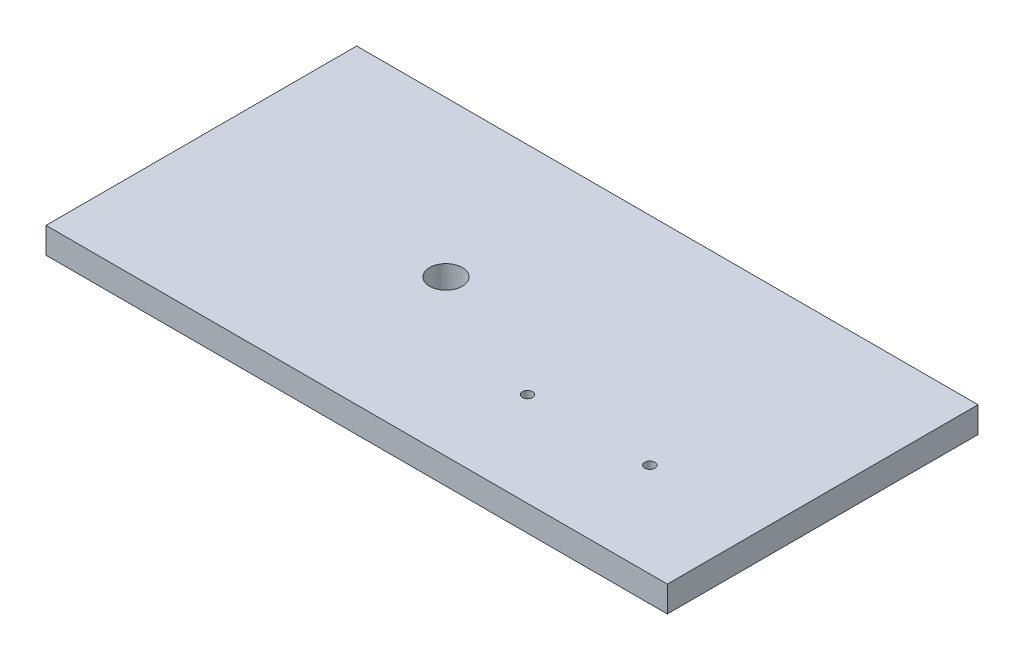
ISO-10303-21;
HEADER;
FILE_DESCRIPTION(('STEP AP214'),'2;1');
FILE_NAME('part.step','',(''),(''),'','','');
FILE_SCHEMA(('AUTOMOTIVE_DESIGN { 1 0 10303 214 1 1 1 1 }'));
ENDSEC;
DATA;
#1=APPLICATION_CONTEXT('core data for automotive mechanical design processes');
#2=APPLICATION_PROTOCOL_DEFINITION('international standard','automotive_design',2000,#1);
#3=PRODUCT_CONTEXT('',#1,'mechanical');
#4=PRODUCT('Part','Part','',(#3));
#5=PRODUCT_RELATED_PRODUCT_CATEGORY('part','',(#4));
#6=PRODUCT_DEFINITION_FORMATION('','',#4);
#7=PRODUCT_DEFINITION_CONTEXT('part definition',#1,'design');
#8=PRODUCT_DEFINITION('design','',#6,#7);
#9=PRODUCT_DEFINITION_SHAPE('','',#8);
#10=(LENGTH_UNIT() NAMED_UNIT(*) SI_UNIT(.MILLI.,.METRE.));
#11=(NAMED_UNIT(*) PLANE_ANGLE_UNIT() SI_UNIT($,.RADIAN.));
#12=(NAMED_UNIT(*) SI_UNIT($,.STERADIAN.) SOLID_ANGLE_UNIT());
#13=UNCERTAINTY_MEASURE_WITH_UNIT(LENGTH_MEASURE(1.E-05),#10,'distance_accuracy_value','');
#14=(GEOMETRIC_REPRESENTATION_CONTEXT(3) GLOBAL_UNCERTAINTY_ASSIGNED_CONTEXT((#13)) GLOBAL_UNIT_ASSIGNED_CONTEXT((#10,
#11,#12)) REPRESENTATION_CONTEXT('',''));
#15=CARTESIAN_POINT('',(0.,0.,0.));
#16=DIRECTION('',(0.,0.,1.));
#17=DIRECTION('',(1.,0.,0.));
#18=AXIS2_PLACEMENT_3D('',#15,#16,#17);
#19=CARTESIAN_POINT('',(0.,12.7,0.));
#20=DIRECTION('',(1.,0.,0.));
#21=DIRECTION('',(0.,0.,-1.));
#22=AXIS2_PLACEMENT_3D('',#19,#20,#21);
#23=PLANE('',#22);
#24=DIRECTION('',(0.,0.,1.));
#25=VECTOR('',#24,1.);
#26=CARTESIAN_POINT('',(0.,0.,0.));
#27=LINE('',#26,#25);
#28=CARTESIAN_POINT('',(0.,0.,0.));
#29=VERTEX_POINT('',#28);
#30=CARTESIAN_POINT('',(0.,0.,152.4));
#31=VERTEX_POINT('',#30);
#32=EDGE_CURVE('E106',#29,#31,#27,.T.);
#33=ORIENTED_EDGE('',*,*,#32,.T.);
#34=DIRECTION('',(0.,-1.,0.));
#35=VECTOR('',#34,1.);
#36=CARTESIAN_POINT('',(0.,12.7,152.4));
#37=LINE('',#36,#35);
#38=CARTESIAN_POINT('',(0.,12.7,152.4));
#39=VERTEX_POINT('',#38);
#40=EDGE_CURVE('E11',#39,#31,#37,.T.);
#41=ORIENTED_EDGE('',*,*,#40,.F.);
#42=DIRECTION('',(0.,0.,1.));
#43=VECTOR('',#42,1.);
#44=CARTESIAN_POINT('',(0.,12.7,0.));
#45=LINE('',#44,#43);
#46=CARTESIAN_POINT('',(0.,12.7,0.));
#47=VERTEX_POINT('',#46);
#48=EDGE_CURVE('E90',#47,#39,#45,.T.);
#49=ORIENTED_EDGE('',*,*,#48,.F.);
#50=DIRECTION('',(0.,-1.,0.));
#51=VECTOR('',#50,1.);
#52=CARTESIAN_POINT('',(0.,12.7,0.));
#53=LINE('',#52,#51);
#54=EDGE_CURVE('E102',#47,#29,#53,.T.);
#55=ORIENTED_EDGE('',*,*,#54,.T.);
#56=EDGE_LOOP('',(#33,#41,#49,#55));
#57=FACE_BOUND('',#56,.T.);
#58=ADVANCED_FACE('F38',(#57),#23,.F.);
#59=CARTESIAN_POINT('',(0.,12.7,152.4));
#60=DIRECTION('',(0.,0.,-1.));
#61=DIRECTION('',(-1.,0.,0.));
#62=AXIS2_PLACEMENT_3D('',#59,#60,#61);
#63=PLANE('',#62);
#64=DIRECTION('',(1.,0.,0.));
#65=VECTOR('',#64,1.);
#66=CARTESIAN_POINT('',(0.,0.,152.4));
#67=LINE('',#66,#65);
#68=CARTESIAN_POINT('',(304.8,0.,152.4));
#69=VERTEX_POINT('',#68);
#70=EDGE_CURVE('E95',#31,#69,#67,.T.);
#71=ORIENTED_EDGE('',*,*,#70,.T.);
#72=DIRECTION('',(0.,-1.,0.));
#73=VECTOR('',#72,1.);
#74=CARTESIAN_POINT('',(304.8,12.7,152.4));
#75=LINE('',#74,#73);
#76=CARTESIAN_POINT('',(304.8,12.7,152.4));
#77=VERTEX_POINT('',#76);
#78=EDGE_CURVE('E47',#77,#69,#75,.T.);
#79=ORIENTED_EDGE('',*,*,#78,.F.);
#80=DIRECTION('',(1.,0.,0.));
#81=VECTOR('',#80,1.);
#82=CARTESIAN_POINT('',(0.,12.7,152.4));
#83=LINE('',#82,#81);
#84=EDGE_CURVE('E85',#39,#77,#83,.T.);
#85=ORIENTED_EDGE('',*,*,#84,.F.);
#86=ORIENTED_EDGE('',*,*,#40,.T.);
#87=EDGE_LOOP('',(#71,#79,#85,#86));
#88=FACE_BOUND('',#87,.T.);
#89=ADVANCED_FACE('F94',(#88),#63,.F.);
#90=CARTESIAN_POINT('',(304.8,12.7,0.));
#91=DIRECTION('',(-1.,0.,0.));
#92=DIRECTION('',(0.,0.,1.));
#93=AXIS2_PLACEMENT_3D('',#90,#91,#92);
#94=PLANE('',#93);
#95=DIRECTION('',(0.,0.,-1.));
#96=VECTOR('',#95,1.);
#97=CARTESIAN_POINT('',(304.8,0.,0.));
#98=LINE('',#97,#96);
#99=CARTESIAN_POINT('',(304.8,0.,0.));
#100=VERTEX_POINT('',#99);
#101=EDGE_CURVE('E72',#69,#100,#98,.T.);
#102=ORIENTED_EDGE('',*,*,#101,.T.);
#103=DIRECTION('',(0.,-1.,0.));
#104=VECTOR('',#103,1.);
#105=CARTESIAN_POINT('',(304.8,12.7,0.));
#106=LINE('',#105,#104);
#107=CARTESIAN_POINT('',(304.8,12.7,0.));
#108=VERTEX_POINT('',#107);
#109=EDGE_CURVE('E97',#108,#100,#106,.T.);
#110=ORIENTED_EDGE('',*,*,#109,.F.);
#111=DIRECTION('',(0.,0.,-1.));
#112=VECTOR('',#111,1.);
#113=CARTESIAN_POINT('',(304.8,12.7,0.));
#114=LINE('',#113,#112);
#115=EDGE_CURVE('E88',#77,#108,#114,.T.);
#116=ORIENTED_EDGE('',*,*,#115,.F.);
#117=ORIENTED_EDGE('',*,*,#78,.T.);
#118=EDGE_LOOP('',(#102,#110,#116,#117));
#119=FACE_BOUND('',#118,.T.);
#120=ADVANCED_FACE('F98',(#119),#94,.F.);
#121=CARTESIAN_POINT('',(0.,12.7,0.));
#122=DIRECTION('',(0.,0.,1.));
#123=DIRECTION('',(1.,0.,0.));
#124=AXIS2_PLACEMENT_3D('',#121,#122,#123);
#125=PLANE('',#124);
#126=DIRECTION('',(-1.,0.,0.));
#127=VECTOR('',#126,1.);
#128=CARTESIAN_POINT('',(0.,0.,0.));
#129=LINE('',#128,#127);
#130=EDGE_CURVE('E78',#100,#29,#129,.T.);
#131=ORIENTED_EDGE('',*,*,#130,.T.);
#132=ORIENTED_EDGE('',*,*,#54,.F.);
#133=DIRECTION('',(-1.,0.,0.));
#134=VECTOR('',#133,1.);
#135=CARTESIAN_POINT('',(0.,12.7,0.));
#136=LINE('',#135,#134);
#137=EDGE_CURVE('E55',#108,#47,#136,.T.);
#138=ORIENTED_EDGE('',*,*,#137,.F.);
#139=ORIENTED_EDGE('',*,*,#109,.T.);
#140=EDGE_LOOP('',(#131,#132,#138,#139));
#141=FACE_BOUND('',#140,.T.);
#142=ADVANCED_FACE('F120',(#141),#125,.F.);
#143=CARTESIAN_POINT('',(0.,12.7,0.));
#144=DIRECTION('',(0.,1.,0.));
#145=DIRECTION('',(0.,0.,1.));
#146=AXIS2_PLACEMENT_3D('',#143,#144,#145);
#147=PLANE('',#146);
#148=CARTESIAN_POINT('',(120.,12.7,76.2));
#149=DIRECTION('',(0.,1.,0.));
#150=DIRECTION('',(0.,0.,1.));
#151=AXIS2_PLACEMENT_3D('',#148,#149,#150);
#152=CIRCLE('',#151,8.00000000000001);
#153=CARTESIAN_POINT('',(120.,12.7,84.2));
#154=VERTEX_POINT('',#153);
#155=EDGE_CURVE('E143',#154,#154,#152,.T.);
#156=ORIENTED_EDGE('',*,*,#155,.F.);
#157=EDGE_LOOP('',(#156));
#158=FACE_BOUND('',#157,.T.);
#159=CARTESIAN_POINT('',(250.,12.7,106.2));
#160=DIRECTION('',(0.,1.,0.));
#161=DIRECTION('',(0.,0.,1.));
#162=AXIS2_PLACEMENT_3D('',#159,#160,#161);
#163=CIRCLE('',#162,2.50000000000002);
#164=CARTESIAN_POINT('',(250.,12.7,108.7));
#165=VERTEX_POINT('',#164);
#166=EDGE_CURVE('E135',#165,#165,#163,.T.);
#167=ORIENTED_EDGE('',*,*,#166,.F.);
#168=EDGE_LOOP('',(#167));
#169=FACE_BOUND('',#168,.T.);
#170=CARTESIAN_POINT('',(190.,12.7,106.2));
#171=DIRECTION('',(0.,1.,0.));
#172=DIRECTION('',(0.,0.,1.));
#173=AXIS2_PLACEMENT_3D('',#170,#171,#172);
#174=CIRCLE('',#173,2.5);
#175=CARTESIAN_POINT('',(190.,12.7,108.7));
#176=VERTEX_POINT('',#175);
#177=EDGE_CURVE('E127',#176,#176,#174,.T.);
#178=ORIENTED_EDGE('',*,*,#177,.F.);
#179=EDGE_LOOP('',(#178));
#180=FACE_BOUND('',#179,.T.);
#181=ORIENTED_EDGE('',*,*,#48,.T.);
#182=ORIENTED_EDGE('',*,*,#84,.T.);
#183=ORIENTED_EDGE('',*,*,#115,.T.);
#184=ORIENTED_EDGE('',*,*,#137,.T.);
#185=EDGE_LOOP('',(#181,#182,#183,#184));
#186=FACE_BOUND('',#185,.T.);
#187=ADVANCED_FACE('F86',(#158,#169,#180,#186),#147,.T.);
#188=CARTESIAN_POINT('',(0.,0.,0.));
#189=DIRECTION('',(0.,1.,0.));
#190=DIRECTION('',(0.,0.,1.));
#191=AXIS2_PLACEMENT_3D('',#188,#189,#190);
#192=PLANE('',#191);
#193=CARTESIAN_POINT('',(120.,0.,76.2));
#194=DIRECTION('',(0.,1.,0.));
#195=DIRECTION('',(0.,0.,1.));
#196=AXIS2_PLACEMENT_3D('',#193,#194,#195);
#197=CIRCLE('',#196,8.00000000000001);
#198=CARTESIAN_POINT('',(120.,0.,84.2));
#199=VERTEX_POINT('',#198);
#200=EDGE_CURVE('E110',#199,#199,#197,.T.);
#201=ORIENTED_EDGE('',*,*,#200,.T.);
#202=EDGE_LOOP('',(#201));
#203=FACE_BOUND('',#202,.T.);
#204=CARTESIAN_POINT('',(250.,0.,106.2));
#205=DIRECTION('',(0.,1.,0.));
#206=DIRECTION('',(0.,0.,1.));
#207=AXIS2_PLACEMENT_3D('',#204,#205,#206);
#208=CIRCLE('',#207,2.50000000000002);
#209=CARTESIAN_POINT('',(250.,0.,108.7));
#210=VERTEX_POINT('',#209);
#211=EDGE_CURVE('E139',#210,#210,#208,.T.);
#212=ORIENTED_EDGE('',*,*,#211,.T.);
#213=EDGE_LOOP('',(#212));
#214=FACE_BOUND('',#213,.T.);
#215=CARTESIAN_POINT('',(190.,0.,106.2));
#216=DIRECTION('',(0.,1.,0.));
#217=DIRECTION('',(0.,0.,1.));
#218=AXIS2_PLACEMENT_3D('',#215,#216,#217);
#219=CIRCLE('',#218,2.5);
#220=CARTESIAN_POINT('',(190.,0.,108.7));
#221=VERTEX_POINT('',#220);
#222=EDGE_CURVE('E131',#221,#221,#219,.T.);
#223=ORIENTED_EDGE('',*,*,#222,.T.);
#224=EDGE_LOOP('',(#223));
#225=FACE_BOUND('',#224,.T.);
#226=ORIENTED_EDGE('',*,*,#32,.F.);
#227=ORIENTED_EDGE('',*,*,#130,.F.);
#228=ORIENTED_EDGE('',*,*,#101,.F.);
#229=ORIENTED_EDGE('',*,*,#70,.F.);
#230=EDGE_LOOP('',(#226,#227,#228,#229));
#231=FACE_BOUND('',#230,.T.);
#232=ADVANCED_FACE('F123',(#203,#214,#225,#231),#192,.F.);
#233=CARTESIAN_POINT('',(190.,0.,106.2));
#234=DIRECTION('',(0.,1.,0.));
#235=DIRECTION('',(0.,0.,1.));
#236=AXIS2_PLACEMENT_3D('',#233,#234,#235);
#237=CYLINDRICAL_SURFACE('',#236,2.5);
#238=ORIENTED_EDGE('',*,*,#222,.F.);
#239=EDGE_LOOP('',(#238));
#240=FACE_BOUND('',#239,.T.);
#241=ORIENTED_EDGE('',*,*,#177,.T.);
#242=EDGE_LOOP('',(#241));
#243=FACE_BOUND('',#242,.T.);
#244=ADVANCED_FACE('F167',(#240,#243),#237,.F.);
#245=CARTESIAN_POINT('',(250.,0.,106.2));
#246=DIRECTION('',(0.,1.,0.));
#247=DIRECTION('',(0.,0.,1.));
#248=AXIS2_PLACEMENT_3D('',#245,#246,#247);
#249=CYLINDRICAL_SURFACE('',#248,2.50000000000002);
#250=ORIENTED_EDGE('',*,*,#211,.F.);
#251=EDGE_LOOP('',(#250));
#252=FACE_BOUND('',#251,.T.);
#253=ORIENTED_EDGE('',*,*,#166,.T.);
#254=EDGE_LOOP('',(#253));
#255=FACE_BOUND('',#254,.T.);
#256=ADVANCED_FACE('F156',(#252,#255),#249,.F.);
#257=CARTESIAN_POINT('',(120.,0.,76.2));
#258=DIRECTION('',(0.,1.,0.));
#259=DIRECTION('',(0.,0.,1.));
#260=AXIS2_PLACEMENT_3D('',#257,#258,#259);
#261=CYLINDRICAL_SURFACE('',#260,8.00000000000001);
#262=ORIENTED_EDGE('',*,*,#200,.F.);
#263=EDGE_LOOP('',(#262));
#264=FACE_BOUND('',#263,.T.);
#265=ORIENTED_EDGE('',*,*,#155,.T.);
#266=EDGE_LOOP('',(#265));
#267=FACE_BOUND('',#266,.T.);
#268=ADVANCED_FACE('F153',(#264,#267),#261,.F.);
#269=CLOSED_SHELL('',(#58,#89,#120,#142,#187,#232,#244,#256,#268));
#270=MANIFOLD_SOLID_BREP('B2',#269);
#271=ADVANCED_BREP_SHAPE_REPRESENTATION('',(#18,#270),#14);
#272=SHAPE_DEFINITION_REPRESENTATION(#9,#271);
ENDSEC;
END-ISO-10303-21;
